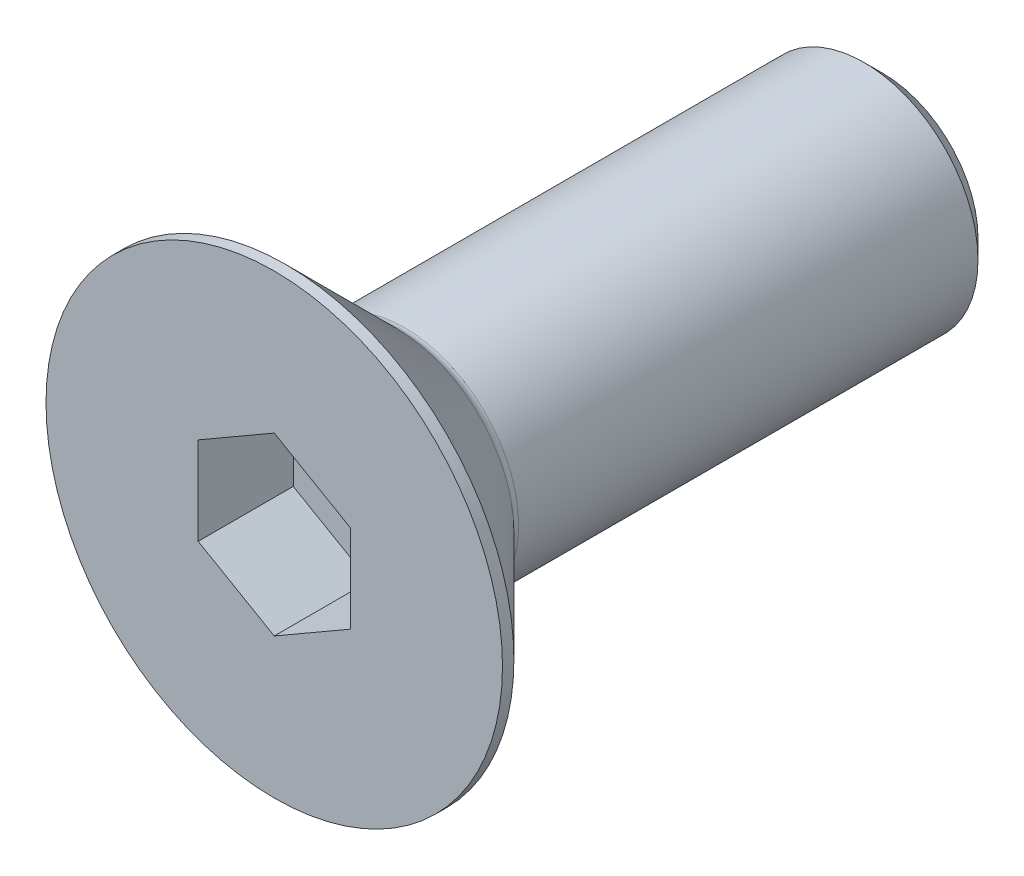
ISO-10303-21;
HEADER;
FILE_DESCRIPTION(('STEP AP214'),'2;1');
FILE_NAME('part.step','',(''),(''),'','','');
FILE_SCHEMA(('AUTOMOTIVE_DESIGN { 1 0 10303 214 1 1 1 1 }'));
ENDSEC;
DATA;
#1=APPLICATION_CONTEXT('core data for automotive mechanical design processes');
#2=APPLICATION_PROTOCOL_DEFINITION('international standard','automotive_design',2000,#1);
#3=PRODUCT_CONTEXT('',#1,'mechanical');
#4=PRODUCT('Part','Part','',(#3));
#5=PRODUCT_RELATED_PRODUCT_CATEGORY('part','',(#4));
#6=PRODUCT_DEFINITION_FORMATION('','',#4);
#7=PRODUCT_DEFINITION_CONTEXT('part definition',#1,'design');
#8=PRODUCT_DEFINITION('design','',#6,#7);
#9=PRODUCT_DEFINITION_SHAPE('','',#8);
#10=(LENGTH_UNIT() NAMED_UNIT(*) SI_UNIT(.MILLI.,.METRE.));
#11=(NAMED_UNIT(*) PLANE_ANGLE_UNIT() SI_UNIT($,.RADIAN.));
#12=(NAMED_UNIT(*) SI_UNIT($,.STERADIAN.) SOLID_ANGLE_UNIT());
#13=UNCERTAINTY_MEASURE_WITH_UNIT(LENGTH_MEASURE(1.E-05),#10,'distance_accuracy_value','');
#14=(GEOMETRIC_REPRESENTATION_CONTEXT(3) GLOBAL_UNCERTAINTY_ASSIGNED_CONTEXT((#13)) GLOBAL_UNIT_ASSIGNED_CONTEXT((#10,
#11,#12)) REPRESENTATION_CONTEXT('',''));
#15=CARTESIAN_POINT('',(0.,0.,0.));
#16=DIRECTION('',(0.,0.,1.));
#17=DIRECTION('',(1.,0.,0.));
#18=AXIS2_PLACEMENT_3D('',#15,#16,#17);
#19=CARTESIAN_POINT('',(0.,0.,-2.5));
#20=DIRECTION('',(0.,0.,1.));
#21=DIRECTION('',(1.,0.,0.));
#22=AXIS2_PLACEMENT_3D('',#19,#20,#21);
#23=PLANE('',#22);
#24=DIRECTION('',(-0.866025403784439,-0.5,0.));
#25=VECTOR('',#24,1.);
#26=CARTESIAN_POINT('',(0.,2.3094010767585,-2.5));
#27=LINE('',#26,#25);
#28=CARTESIAN_POINT('',(0.,2.3094010767585,-2.5));
#29=VERTEX_POINT('',#28);
#30=CARTESIAN_POINT('',(-2.,1.15470053837925,-2.5));
#31=VERTEX_POINT('',#30);
#32=EDGE_CURVE('E83',#29,#31,#27,.T.);
#33=ORIENTED_EDGE('',*,*,#32,.T.);
#34=DIRECTION('',(0.,1.,0.));
#35=VECTOR('',#34,1.);
#36=CARTESIAN_POINT('',(-2.,1.15470053837925,-2.5));
#37=LINE('',#36,#35);
#38=CARTESIAN_POINT('',(-2.,-1.15470053837925,-2.5));
#39=VERTEX_POINT('',#38);
#40=EDGE_CURVE('E67',#31,#39,#37,.F.);
#41=ORIENTED_EDGE('',*,*,#40,.T.);
#42=DIRECTION('',(0.866025403784439,-0.499999999999999,0.));
#43=VECTOR('',#42,1.);
#44=CARTESIAN_POINT('',(-2.,-1.15470053837925,-2.5));
#45=LINE('',#44,#43);
#46=CARTESIAN_POINT('',(0.,-2.3094010767585,-2.5));
#47=VERTEX_POINT('',#46);
#48=EDGE_CURVE('E72',#39,#47,#45,.T.);
#49=ORIENTED_EDGE('',*,*,#48,.T.);
#50=DIRECTION('',(0.866025403784439,0.5,0.));
#51=VECTOR('',#50,1.);
#52=CARTESIAN_POINT('',(0.,-2.3094010767585,-2.5));
#53=LINE('',#52,#51);
#54=CARTESIAN_POINT('',(2.,-1.15470053837925,-2.5));
#55=VERTEX_POINT('',#54);
#56=EDGE_CURVE('E129',#47,#55,#53,.T.);
#57=ORIENTED_EDGE('',*,*,#56,.T.);
#58=DIRECTION('',(0.,1.,0.));
#59=VECTOR('',#58,1.);
#60=CARTESIAN_POINT('',(2.,-1.15470053837925,-2.5));
#61=LINE('',#60,#59);
#62=CARTESIAN_POINT('',(2.,1.15470053837925,-2.5));
#63=VERTEX_POINT('',#62);
#64=EDGE_CURVE('E133',#55,#63,#61,.T.);
#65=ORIENTED_EDGE('',*,*,#64,.T.);
#66=DIRECTION('',(-0.866025403784439,0.499999999999999,0.));
#67=VECTOR('',#66,1.);
#68=CARTESIAN_POINT('',(2.,1.15470053837925,-2.5));
#69=LINE('',#68,#67);
#70=EDGE_CURVE('E138',#63,#29,#69,.T.);
#71=ORIENTED_EDGE('',*,*,#70,.T.);
#72=EDGE_LOOP('',(#33,#41,#49,#57,#65,#71));
#73=FACE_BOUND('',#72,.T.);
#74=ADVANCED_FACE('F16',(#73),#23,.T.);
#75=CARTESIAN_POINT('',(-2.,-1.15470053837925,0.));
#76=DIRECTION('',(-0.499999999999999,-0.866025403784439,0.));
#77=DIRECTION('',(0.866025403784439,-0.499999999999999,0.));
#78=AXIS2_PLACEMENT_3D('',#75,#76,#77);
#79=PLANE('',#78);
#80=DIRECTION('',(0.,0.,1.));
#81=VECTOR('',#80,1.);
#82=CARTESIAN_POINT('',(-2.,-1.15470053837925,0.));
#83=LINE('',#82,#81);
#84=CARTESIAN_POINT('',(-2.,-1.15470053837925,0.));
#85=VERTEX_POINT('',#84);
#86=EDGE_CURVE('E74',#39,#85,#83,.T.);
#87=ORIENTED_EDGE('',*,*,#86,.T.);
#88=DIRECTION('',(-0.866025403784439,0.499999999999999,0.));
#89=VECTOR('',#88,1.);
#90=CARTESIAN_POINT('',(0.,-2.3094010767585,0.));
#91=LINE('',#90,#89);
#92=CARTESIAN_POINT('',(0.,-2.3094010767585,0.));
#93=VERTEX_POINT('',#92);
#94=EDGE_CURVE('E127',#93,#85,#91,.T.);
#95=ORIENTED_EDGE('',*,*,#94,.F.);
#96=DIRECTION('',(0.,0.,1.));
#97=VECTOR('',#96,1.);
#98=CARTESIAN_POINT('',(0.,-2.3094010767585,0.));
#99=LINE('',#98,#97);
#100=EDGE_CURVE('E77',#93,#47,#99,.F.);
#101=ORIENTED_EDGE('',*,*,#100,.T.);
#102=ORIENTED_EDGE('',*,*,#48,.F.);
#103=EDGE_LOOP('',(#87,#95,#101,#102));
#104=FACE_BOUND('',#103,.T.);
#105=ADVANCED_FACE('F73',(#104),#79,.F.);
#106=CARTESIAN_POINT('',(-2.,1.15470053837925,0.));
#107=DIRECTION('',(-1.,0.,0.));
#108=DIRECTION('',(0.,0.,1.));
#109=AXIS2_PLACEMENT_3D('',#106,#107,#108);
#110=PLANE('',#109);
#111=DIRECTION('',(0.,0.,1.));
#112=VECTOR('',#111,1.);
#113=CARTESIAN_POINT('',(-2.,1.15470053837925,0.));
#114=LINE('',#113,#112);
#115=CARTESIAN_POINT('',(-2.,1.15470053837925,0.));
#116=VERTEX_POINT('',#115);
#117=EDGE_CURVE('E85',#31,#116,#114,.T.);
#118=ORIENTED_EDGE('',*,*,#117,.T.);
#119=DIRECTION('',(0.,1.,0.));
#120=VECTOR('',#119,1.);
#121=CARTESIAN_POINT('',(-2.,0.,0.));
#122=LINE('',#121,#120);
#123=EDGE_CURVE('E89',#85,#116,#122,.T.);
#124=ORIENTED_EDGE('',*,*,#123,.F.);
#125=ORIENTED_EDGE('',*,*,#86,.F.);
#126=ORIENTED_EDGE('',*,*,#40,.F.);
#127=EDGE_LOOP('',(#118,#124,#125,#126));
#128=FACE_BOUND('',#127,.T.);
#129=ADVANCED_FACE('F87',(#128),#110,.F.);
#130=CARTESIAN_POINT('',(0.,2.3094010767585,0.));
#131=DIRECTION('',(-0.5,0.866025403784439,0.));
#132=DIRECTION('',(-0.866025403784439,-0.5,0.));
#133=AXIS2_PLACEMENT_3D('',#130,#131,#132);
#134=PLANE('',#133);
#135=DIRECTION('',(0.,0.,1.));
#136=VECTOR('',#135,1.);
#137=CARTESIAN_POINT('',(0.,2.3094010767585,0.));
#138=LINE('',#137,#136);
#139=CARTESIAN_POINT('',(0.,2.3094010767585,0.));
#140=VERTEX_POINT('',#139);
#141=EDGE_CURVE('E140',#29,#140,#138,.T.);
#142=ORIENTED_EDGE('',*,*,#141,.T.);
#143=DIRECTION('',(0.866025403784439,0.5,0.));
#144=VECTOR('',#143,1.);
#145=CARTESIAN_POINT('',(-2.,1.15470053837925,0.));
#146=LINE('',#145,#144);
#147=EDGE_CURVE('E123',#116,#140,#146,.T.);
#148=ORIENTED_EDGE('',*,*,#147,.F.);
#149=ORIENTED_EDGE('',*,*,#117,.F.);
#150=ORIENTED_EDGE('',*,*,#32,.F.);
#151=EDGE_LOOP('',(#142,#148,#149,#150));
#152=FACE_BOUND('',#151,.T.);
#153=ADVANCED_FACE('F144',(#152),#134,.F.);
#154=CARTESIAN_POINT('',(2.,1.15470053837925,0.));
#155=DIRECTION('',(0.499999999999999,0.866025403784439,0.));
#156=DIRECTION('',(-0.866025403784439,0.499999999999999,0.));
#157=AXIS2_PLACEMENT_3D('',#154,#155,#156);
#158=PLANE('',#157);
#159=DIRECTION('',(0.,0.,-1.));
#160=VECTOR('',#159,1.);
#161=CARTESIAN_POINT('',(2.,1.15470053837925,0.));
#162=LINE('',#161,#160);
#163=CARTESIAN_POINT('',(2.,1.15470053837925,0.));
#164=VERTEX_POINT('',#163);
#165=EDGE_CURVE('E136',#63,#164,#162,.F.);
#166=ORIENTED_EDGE('',*,*,#165,.T.);
#167=DIRECTION('',(0.866025403784439,-0.499999999999999,0.));
#168=VECTOR('',#167,1.);
#169=CARTESIAN_POINT('',(0.,2.3094010767585,0.));
#170=LINE('',#169,#168);
#171=EDGE_CURVE('E120',#140,#164,#170,.T.);
#172=ORIENTED_EDGE('',*,*,#171,.F.);
#173=ORIENTED_EDGE('',*,*,#141,.F.);
#174=ORIENTED_EDGE('',*,*,#70,.F.);
#175=EDGE_LOOP('',(#166,#172,#173,#174));
#176=FACE_BOUND('',#175,.T.);
#177=ADVANCED_FACE('F155',(#176),#158,.F.);
#178=CARTESIAN_POINT('',(2.,-1.15470053837925,0.));
#179=DIRECTION('',(1.,0.,0.));
#180=DIRECTION('',(0.,0.,-1.));
#181=AXIS2_PLACEMENT_3D('',#178,#179,#180);
#182=PLANE('',#181);
#183=DIRECTION('',(0.,0.,1.));
#184=VECTOR('',#183,1.);
#185=CARTESIAN_POINT('',(2.,-1.15470053837925,0.));
#186=LINE('',#185,#184);
#187=CARTESIAN_POINT('',(2.,-1.15470053837925,0.));
#188=VERTEX_POINT('',#187);
#189=EDGE_CURVE('E35',#55,#188,#186,.T.);
#190=ORIENTED_EDGE('',*,*,#189,.T.);
#191=DIRECTION('',(0.,1.,0.));
#192=VECTOR('',#191,1.);
#193=CARTESIAN_POINT('',(2.,0.,0.));
#194=LINE('',#193,#192);
#195=EDGE_CURVE('E117',#164,#188,#194,.F.);
#196=ORIENTED_EDGE('',*,*,#195,.F.);
#197=ORIENTED_EDGE('',*,*,#165,.F.);
#198=ORIENTED_EDGE('',*,*,#64,.F.);
#199=EDGE_LOOP('',(#190,#196,#197,#198));
#200=FACE_BOUND('',#199,.T.);
#201=ADVANCED_FACE('F153',(#200),#182,.F.);
#202=CARTESIAN_POINT('',(0.,-2.3094010767585,0.));
#203=DIRECTION('',(0.5,-0.866025403784439,0.));
#204=DIRECTION('',(0.866025403784439,0.5,0.));
#205=AXIS2_PLACEMENT_3D('',#202,#203,#204);
#206=PLANE('',#205);
#207=ORIENTED_EDGE('',*,*,#100,.F.);
#208=DIRECTION('',(-0.866025403784439,-0.5,0.));
#209=VECTOR('',#208,1.);
#210=CARTESIAN_POINT('',(2.,-1.15470053837925,0.));
#211=LINE('',#210,#209);
#212=EDGE_CURVE('E114',#188,#93,#211,.T.);
#213=ORIENTED_EDGE('',*,*,#212,.F.);
#214=ORIENTED_EDGE('',*,*,#189,.F.);
#215=ORIENTED_EDGE('',*,*,#56,.F.);
#216=EDGE_LOOP('',(#207,#213,#214,#215));
#217=FACE_BOUND('',#216,.T.);
#218=ADVANCED_FACE('F151',(#217),#206,.F.);
#219=CARTESIAN_POINT('',(3.,0.,0.));
#220=DIRECTION('',(0.,0.,1.));
#221=DIRECTION('',(1.,0.,0.));
#222=AXIS2_PLACEMENT_3D('',#219,#220,#221);
#223=PLANE('',#222);
#224=ORIENTED_EDGE('',*,*,#195,.T.);
#225=ORIENTED_EDGE('',*,*,#212,.T.);
#226=ORIENTED_EDGE('',*,*,#94,.T.);
#227=ORIENTED_EDGE('',*,*,#123,.T.);
#228=ORIENTED_EDGE('',*,*,#147,.T.);
#229=ORIENTED_EDGE('',*,*,#171,.T.);
#230=EDGE_LOOP('',(#224,#225,#226,#227,#228,#229));
#231=FACE_BOUND('',#230,.T.);
#232=CARTESIAN_POINT('',(0.,0.,0.));
#233=DIRECTION('',(0.,0.,-1.));
#234=DIRECTION('',(-1.,0.,0.));
#235=AXIS2_PLACEMENT_3D('',#232,#233,#234);
#236=CIRCLE('',#235,6.);
#237=CARTESIAN_POINT('',(-6.,0.,0.));
#238=VERTEX_POINT('',#237);
#239=EDGE_CURVE('E20',#238,#238,#236,.T.);
#240=ORIENTED_EDGE('',*,*,#239,.F.);
#241=EDGE_LOOP('',(#240));
#242=FACE_BOUND('',#241,.T.);
#243=ADVANCED_FACE('F148',(#231,#242),#223,.T.);
#244=CARTESIAN_POINT('',(0.,0.,-0.150000000000001));
#245=DIRECTION('',(0.,0.,-1.));
#246=DIRECTION('',(-1.,0.,0.));
#247=AXIS2_PLACEMENT_3D('',#244,#245,#246);
#248=CYLINDRICAL_SURFACE('',#247,6.);
#249=ORIENTED_EDGE('',*,*,#239,.T.);
#250=EDGE_LOOP('',(#249));
#251=FACE_BOUND('',#250,.T.);
#252=CARTESIAN_POINT('',(0.,0.,-0.299999998617295));
#253=DIRECTION('',(0.,0.,1.));
#254=DIRECTION('',(1.,0.,0.));
#255=AXIS2_PLACEMENT_3D('',#252,#253,#254);
#256=CIRCLE('',#255,5.99999999872125);
#257=CARTESIAN_POINT('',(5.99999999872125,0.,-0.299999998617295));
#258=VERTEX_POINT('',#257);
#259=EDGE_CURVE('E101',#258,#258,#256,.F.);
#260=ORIENTED_EDGE('',*,*,#259,.F.);
#261=EDGE_LOOP('',(#260));
#262=FACE_BOUND('',#261,.T.);
#263=ADVANCED_FACE('F183',(#251,#262),#248,.T.);
#264=CARTESIAN_POINT('',(0.,0.,-0.299999998617295));
#265=DIRECTION('',(0.,0.,1.));
#266=DIRECTION('',(1.,0.,0.));
#267=AXIS2_PLACEMENT_3D('',#264,#265,#266);
#268=CONICAL_SURFACE('',#267,5.99999999872125,0.78539816249955);
#269=CARTESIAN_POINT('',(0.,0.,-3.21213203435597));
#270=DIRECTION('',(0.,0.,-1.));
#271=DIRECTION('',(0.,1.,0.));
#272=AXIS2_PLACEMENT_3D('',#269,#270,#271);
#273=CIRCLE('',#272,3.08786796564404);
#274=CARTESIAN_POINT('',(0.,3.08786796564404,-3.21213203435597));
#275=VERTEX_POINT('',#274);
#276=EDGE_CURVE('E95',#275,#275,#273,.T.);
#277=ORIENTED_EDGE('',*,*,#276,.F.);
#278=EDGE_LOOP('',(#277));
#279=FACE_BOUND('',#278,.T.);
#280=ORIENTED_EDGE('',*,*,#259,.T.);
#281=EDGE_LOOP('',(#280));
#282=FACE_BOUND('',#281,.T.);
#283=ADVANCED_FACE('F179',(#279,#282),#268,.T.);
#284=CARTESIAN_POINT('',(1.5,0.,-16.));
#285=DIRECTION('',(0.,0.,-1.));
#286=DIRECTION('',(-1.,0.,0.));
#287=AXIS2_PLACEMENT_3D('',#284,#285,#286);
#288=PLANE('',#287);
#289=CARTESIAN_POINT('',(0.,0.,-16.0000000002469));
#290=DIRECTION('',(0.,0.,1.));
#291=DIRECTION('',(1.,0.,0.));
#292=AXIS2_PLACEMENT_3D('',#289,#290,#291);
#293=CIRCLE('',#292,2.5000000002251);
#294=CARTESIAN_POINT('',(2.5000000002251,0.,-16.0000000002469));
#295=VERTEX_POINT('',#294);
#296=EDGE_CURVE('E93',#295,#295,#293,.T.);
#297=ORIENTED_EDGE('',*,*,#296,.F.);
#298=EDGE_LOOP('',(#297));
#299=FACE_BOUND('',#298,.T.);
#300=ADVANCED_FACE('F176',(#299),#288,.T.);
#301=CARTESIAN_POINT('',(0.,0.,-3.42426406871193));
#302=DIRECTION('',(0.,0.,-1.));
#303=DIRECTION('',(0.,1.,0.));
#304=AXIS2_PLACEMENT_3D('',#301,#302,#303);
#305=TOROIDAL_SURFACE('',#304,3.3,0.3);
#306=CARTESIAN_POINT('',(0.,0.,-3.42426406871193));
#307=DIRECTION('',(0.,0.,-1.));
#308=DIRECTION('',(-1.,0.,0.));
#309=AXIS2_PLACEMENT_3D('',#306,#307,#308);
#310=CIRCLE('',#309,3.);
#311=CARTESIAN_POINT('',(-3.,0.,-3.42426406871193));
#312=VERTEX_POINT('',#311);
#313=EDGE_CURVE('E26',#312,#312,#310,.T.);
#314=ORIENTED_EDGE('',*,*,#313,.F.);
#315=EDGE_LOOP('',(#314));
#316=FACE_BOUND('',#315,.T.);
#317=ORIENTED_EDGE('',*,*,#276,.T.);
#318=EDGE_LOOP('',(#317));
#319=FACE_BOUND('',#318,.T.);
#320=ADVANCED_FACE('F18',(#316,#319),#305,.F.);
#321=CARTESIAN_POINT('',(0.,0.,-15.499999999804));
#322=DIRECTION('',(0.,0.,1.));
#323=DIRECTION('',(1.,0.,0.));
#324=AXIS2_PLACEMENT_3D('',#321,#322,#323);
#325=CONICAL_SURFACE('',#324,2.99999999975853,0.785398162487954);
#326=ORIENTED_EDGE('',*,*,#296,.T.);
#327=EDGE_LOOP('',(#326));
#328=FACE_BOUND('',#327,.T.);
#329=CARTESIAN_POINT('',(0.,0.,-15.5));
#330=DIRECTION('',(0.,0.,-1.));
#331=DIRECTION('',(-1.,0.,0.));
#332=AXIS2_PLACEMENT_3D('',#329,#330,#331);
#333=CIRCLE('',#332,3.);
#334=CARTESIAN_POINT('',(-3.,0.,-15.5));
#335=VERTEX_POINT('',#334);
#336=EDGE_CURVE('E11',#335,#335,#333,.F.);
#337=ORIENTED_EDGE('',*,*,#336,.F.);
#338=EDGE_LOOP('',(#337));
#339=FACE_BOUND('',#338,.T.);
#340=ADVANCED_FACE('F167',(#328,#339),#325,.T.);
#341=CARTESIAN_POINT('',(0.,0.,-9.65));
#342=DIRECTION('',(0.,0.,-1.));
#343=DIRECTION('',(-1.,0.,0.));
#344=AXIS2_PLACEMENT_3D('',#341,#342,#343);
#345=CYLINDRICAL_SURFACE('',#344,3.);
#346=ORIENTED_EDGE('',*,*,#336,.T.);
#347=EDGE_LOOP('',(#346));
#348=FACE_BOUND('',#347,.T.);
#349=ORIENTED_EDGE('',*,*,#313,.T.);
#350=EDGE_LOOP('',(#349));
#351=FACE_BOUND('',#350,.T.);
#352=ADVANCED_FACE('F165',(#348,#351),#345,.T.);
#353=CLOSED_SHELL('',(#74,#105,#129,#153,#177,#201,#218,#243,#263,#283,#300,#320,#340,#352));
#354=MANIFOLD_SOLID_BREP('B1',#353);
#355=ADVANCED_BREP_SHAPE_REPRESENTATION('',(#18,#354),#14);
#356=SHAPE_DEFINITION_REPRESENTATION(#9,#355);
ENDSEC;
END-ISO-10303-21;
